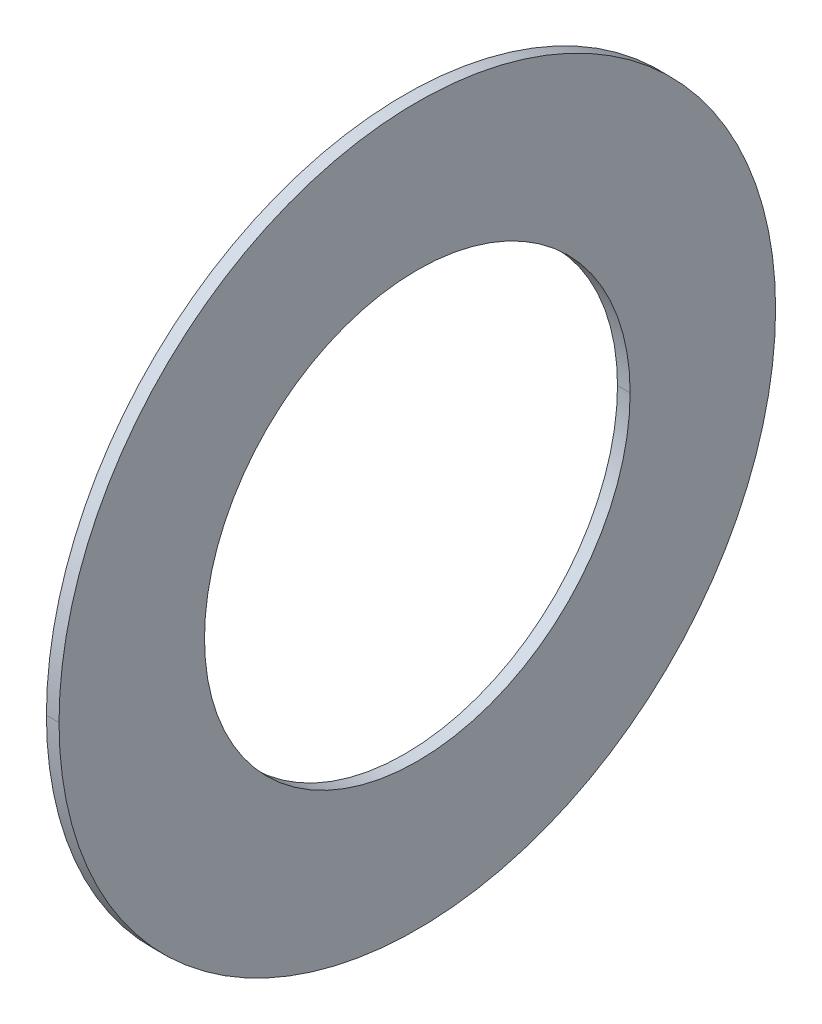
ISO-10303-21;
HEADER;
FILE_DESCRIPTION(('STEP AP214'),'2;1');
FILE_NAME('part.step','',(''),(''),'','','');
FILE_SCHEMA(('AUTOMOTIVE_DESIGN { 1 0 10303 214 1 1 1 1 }'));
ENDSEC;
DATA;
#1=APPLICATION_CONTEXT('core data for automotive mechanical design processes');
#2=APPLICATION_PROTOCOL_DEFINITION('international standard','automotive_design',2000,#1);
#3=PRODUCT_CONTEXT('',#1,'mechanical');
#4=PRODUCT('Part','Part','',(#3));
#5=PRODUCT_RELATED_PRODUCT_CATEGORY('part','',(#4));
#6=PRODUCT_DEFINITION_FORMATION('','',#4);
#7=PRODUCT_DEFINITION_CONTEXT('part definition',#1,'design');
#8=PRODUCT_DEFINITION('design','',#6,#7);
#9=PRODUCT_DEFINITION_SHAPE('','',#8);
#10=(LENGTH_UNIT() NAMED_UNIT(*) SI_UNIT(.MILLI.,.METRE.));
#11=(NAMED_UNIT(*) PLANE_ANGLE_UNIT() SI_UNIT($,.RADIAN.));
#12=(NAMED_UNIT(*) SI_UNIT($,.STERADIAN.) SOLID_ANGLE_UNIT());
#13=UNCERTAINTY_MEASURE_WITH_UNIT(LENGTH_MEASURE(1.E-05),#10,'distance_accuracy_value','');
#14=(GEOMETRIC_REPRESENTATION_CONTEXT(3) GLOBAL_UNCERTAINTY_ASSIGNED_CONTEXT((#13)) GLOBAL_UNIT_ASSIGNED_CONTEXT((#10,
#11,#12)) REPRESENTATION_CONTEXT('',''));
#15=CARTESIAN_POINT('',(0.,0.,0.));
#16=DIRECTION('',(0.,0.,1.));
#17=DIRECTION('',(1.,0.,0.));
#18=AXIS2_PLACEMENT_3D('',#15,#16,#17);
#19=CARTESIAN_POINT('',(4.6875,6.65,0.));
#20=DIRECTION('',(-1.,0.,0.));
#21=DIRECTION('',(0.,0.,1.));
#22=AXIS2_PLACEMENT_3D('',#19,#20,#21);
#23=PLANE('',#22);
#24=CARTESIAN_POINT('',(4.6875,0.,0.));
#25=DIRECTION('',(1.,0.,0.));
#26=DIRECTION('',(0.,0.,-1.));
#27=AXIS2_PLACEMENT_3D('',#24,#25,#26);
#28=CIRCLE('',#27,3.95);
#29=CARTESIAN_POINT('',(4.6875,0.,-3.95));
#30=VERTEX_POINT('',#29);
#31=CARTESIAN_POINT('',(4.6875,0.,3.95));
#32=VERTEX_POINT('',#31);
#33=EDGE_CURVE('E11',#30,#32,#28,.T.);
#34=ORIENTED_EDGE('',*,*,#33,.T.);
#35=CARTESIAN_POINT('',(4.6875,0.,0.));
#36=DIRECTION('',(1.,0.,0.));
#37=DIRECTION('',(0.,0.,-1.));
#38=AXIS2_PLACEMENT_3D('',#35,#36,#37);
#39=CIRCLE('',#38,3.95);
#40=EDGE_CURVE('E25',#32,#30,#39,.T.);
#41=ORIENTED_EDGE('',*,*,#40,.T.);
#42=EDGE_LOOP('',(#34,#41));
#43=FACE_BOUND('',#42,.T.);
#44=CARTESIAN_POINT('',(4.6875,0.,0.));
#45=DIRECTION('',(1.,0.,0.));
#46=DIRECTION('',(0.,0.,-1.));
#47=AXIS2_PLACEMENT_3D('',#44,#45,#46);
#48=CIRCLE('',#47,6.65);
#49=CARTESIAN_POINT('',(4.6875,0.,-6.65));
#50=VERTEX_POINT('',#49);
#51=CARTESIAN_POINT('',(4.6875,0.,6.65));
#52=VERTEX_POINT('',#51);
#53=EDGE_CURVE('E96',#50,#52,#48,.T.);
#54=ORIENTED_EDGE('',*,*,#53,.F.);
#55=CARTESIAN_POINT('',(4.6875,0.,0.));
#56=DIRECTION('',(1.,0.,0.));
#57=DIRECTION('',(0.,0.,-1.));
#58=AXIS2_PLACEMENT_3D('',#55,#56,#57);
#59=CIRCLE('',#58,6.65);
#60=EDGE_CURVE('E91',#52,#50,#59,.T.);
#61=ORIENTED_EDGE('',*,*,#60,.F.);
#62=EDGE_LOOP('',(#54,#61));
#63=FACE_BOUND('',#62,.T.);
#64=ADVANCED_FACE('F17',(#43,#63),#23,.T.);
#65=CARTESIAN_POINT('',(4.92175,0.,0.));
#66=DIRECTION('',(-1.,0.,0.));
#67=DIRECTION('',(0.,1.,0.));
#68=AXIS2_PLACEMENT_3D('',#65,#66,#67);
#69=CYLINDRICAL_SURFACE('',#68,6.65);
#70=ORIENTED_EDGE('',*,*,#60,.T.);
#71=DIRECTION('',(-1.,0.,0.));
#72=VECTOR('',#71,1.);
#73=CARTESIAN_POINT('',(4.92175,0.,-6.65));
#74=LINE('',#73,#72);
#75=CARTESIAN_POINT('',(4.92175,0.,-6.65));
#76=VERTEX_POINT('',#75);
#77=EDGE_CURVE('E86',#76,#50,#74,.T.);
#78=ORIENTED_EDGE('',*,*,#77,.F.);
#79=CARTESIAN_POINT('',(4.92175,0.,0.));
#80=DIRECTION('',(1.,0.,0.));
#81=DIRECTION('',(0.,0.,-1.));
#82=AXIS2_PLACEMENT_3D('',#79,#80,#81);
#83=CIRCLE('',#82,6.65);
#84=CARTESIAN_POINT('',(4.92175,0.,6.65));
#85=VERTEX_POINT('',#84);
#86=EDGE_CURVE('E81',#85,#76,#83,.T.);
#87=ORIENTED_EDGE('',*,*,#86,.F.);
#88=DIRECTION('',(-1.,0.,0.));
#89=VECTOR('',#88,1.);
#90=CARTESIAN_POINT('',(4.92175,0.,6.65));
#91=LINE('',#90,#89);
#92=EDGE_CURVE('E70',#85,#52,#91,.T.);
#93=ORIENTED_EDGE('',*,*,#92,.T.);
#94=EDGE_LOOP('',(#70,#78,#87,#93));
#95=FACE_BOUND('',#94,.T.);
#96=ADVANCED_FACE('F111',(#95),#69,.T.);
#97=CARTESIAN_POINT('',(4.92175,0.,0.));
#98=DIRECTION('',(-1.,0.,0.));
#99=DIRECTION('',(0.,-1.,0.));
#100=AXIS2_PLACEMENT_3D('',#97,#98,#99);
#101=CYLINDRICAL_SURFACE('',#100,6.65);
#102=CARTESIAN_POINT('',(4.92175,0.,0.));
#103=DIRECTION('',(1.,0.,0.));
#104=DIRECTION('',(0.,0.,-1.));
#105=AXIS2_PLACEMENT_3D('',#102,#103,#104);
#106=CIRCLE('',#105,6.65);
#107=EDGE_CURVE('E67',#76,#85,#106,.T.);
#108=ORIENTED_EDGE('',*,*,#107,.F.);
#109=ORIENTED_EDGE('',*,*,#77,.T.);
#110=ORIENTED_EDGE('',*,*,#53,.T.);
#111=ORIENTED_EDGE('',*,*,#92,.F.);
#112=EDGE_LOOP('',(#108,#109,#110,#111));
#113=FACE_BOUND('',#112,.T.);
#114=ADVANCED_FACE('F108',(#113),#101,.T.);
#115=CARTESIAN_POINT('',(4.92175,3.95,0.));
#116=DIRECTION('',(1.,0.,0.));
#117=DIRECTION('',(0.,0.,-1.));
#118=AXIS2_PLACEMENT_3D('',#115,#116,#117);
#119=PLANE('',#118);
#120=ORIENTED_EDGE('',*,*,#107,.T.);
#121=ORIENTED_EDGE('',*,*,#86,.T.);
#122=EDGE_LOOP('',(#120,#121));
#123=FACE_BOUND('',#122,.T.);
#124=CARTESIAN_POINT('',(4.92175,0.,0.));
#125=DIRECTION('',(1.,0.,0.));
#126=DIRECTION('',(0.,0.,-1.));
#127=AXIS2_PLACEMENT_3D('',#124,#125,#126);
#128=CIRCLE('',#127,3.95);
#129=CARTESIAN_POINT('',(4.92175,0.,-3.95));
#130=VERTEX_POINT('',#129);
#131=CARTESIAN_POINT('',(4.92175,0.,3.95));
#132=VERTEX_POINT('',#131);
#133=EDGE_CURVE('E56',#130,#132,#128,.T.);
#134=ORIENTED_EDGE('',*,*,#133,.F.);
#135=CARTESIAN_POINT('',(4.92175,0.,0.));
#136=DIRECTION('',(1.,0.,0.));
#137=DIRECTION('',(0.,0.,-1.));
#138=AXIS2_PLACEMENT_3D('',#135,#136,#137);
#139=CIRCLE('',#138,3.95);
#140=EDGE_CURVE('E52',#132,#130,#139,.T.);
#141=ORIENTED_EDGE('',*,*,#140,.F.);
#142=EDGE_LOOP('',(#134,#141));
#143=FACE_BOUND('',#142,.T.);
#144=ADVANCED_FACE('F54',(#123,#143),#119,.T.);
#145=CARTESIAN_POINT('',(4.92175,0.,0.));
#146=DIRECTION('',(-1.,0.,0.));
#147=DIRECTION('',(0.,1.,0.));
#148=AXIS2_PLACEMENT_3D('',#145,#146,#147);
#149=CYLINDRICAL_SURFACE('',#148,3.95);
#150=ORIENTED_EDGE('',*,*,#40,.F.);
#151=DIRECTION('',(-1.,0.,0.));
#152=VECTOR('',#151,1.);
#153=CARTESIAN_POINT('',(4.92175,0.,3.95));
#154=LINE('',#153,#152);
#155=EDGE_CURVE('E59',#132,#32,#154,.T.);
#156=ORIENTED_EDGE('',*,*,#155,.F.);
#157=ORIENTED_EDGE('',*,*,#140,.T.);
#158=DIRECTION('',(-1.,0.,0.));
#159=VECTOR('',#158,1.);
#160=CARTESIAN_POINT('',(4.92175,0.,-3.95));
#161=LINE('',#160,#159);
#162=EDGE_CURVE('E64',#130,#30,#161,.T.);
#163=ORIENTED_EDGE('',*,*,#162,.T.);
#164=EDGE_LOOP('',(#150,#156,#157,#163));
#165=FACE_BOUND('',#164,.T.);
#166=ADVANCED_FACE('F62',(#165),#149,.F.);
#167=CARTESIAN_POINT('',(4.92175,0.,0.));
#168=DIRECTION('',(-1.,0.,0.));
#169=DIRECTION('',(0.,-1.,0.));
#170=AXIS2_PLACEMENT_3D('',#167,#168,#169);
#171=CYLINDRICAL_SURFACE('',#170,3.95);
#172=ORIENTED_EDGE('',*,*,#133,.T.);
#173=ORIENTED_EDGE('',*,*,#155,.T.);
#174=ORIENTED_EDGE('',*,*,#33,.F.);
#175=ORIENTED_EDGE('',*,*,#162,.F.);
#176=EDGE_LOOP('',(#172,#173,#174,#175));
#177=FACE_BOUND('',#176,.T.);
#178=ADVANCED_FACE('F66',(#177),#171,.F.);
#179=CLOSED_SHELL('',(#64,#96,#114,#144,#166,#178));
#180=MANIFOLD_SOLID_BREP('B1',#179);
#181=ADVANCED_BREP_SHAPE_REPRESENTATION('',(#18,#180),#14);
#182=SHAPE_DEFINITION_REPRESENTATION(#9,#181);
ENDSEC;
END-ISO-10303-21;
